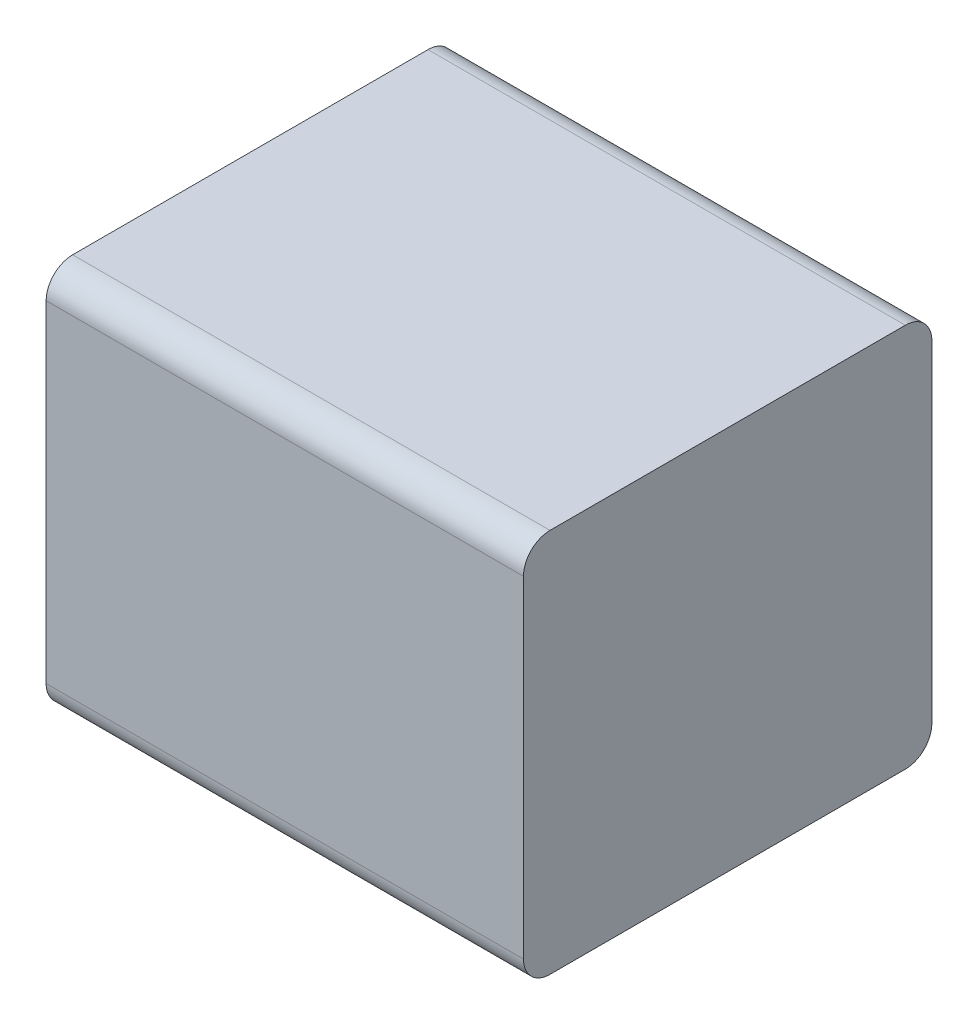
ISO-10303-21;
HEADER;
FILE_DESCRIPTION(('STEP AP214'),'2;1');
FILE_NAME('part.step','',(''),(''),'','','');
FILE_SCHEMA(('AUTOMOTIVE_DESIGN { 1 0 10303 214 1 1 1 1 }'));
ENDSEC;
DATA;
#1=APPLICATION_CONTEXT('core data for automotive mechanical design processes');
#2=APPLICATION_PROTOCOL_DEFINITION('international standard','automotive_design',2000,#1);
#3=PRODUCT_CONTEXT('',#1,'mechanical');
#4=PRODUCT('Part','Part','',(#3));
#5=PRODUCT_RELATED_PRODUCT_CATEGORY('part','',(#4));
#6=PRODUCT_DEFINITION_FORMATION('','',#4);
#7=PRODUCT_DEFINITION_CONTEXT('part definition',#1,'design');
#8=PRODUCT_DEFINITION('design','',#6,#7);
#9=PRODUCT_DEFINITION_SHAPE('','',#8);
#10=(LENGTH_UNIT() NAMED_UNIT(*) SI_UNIT(.MILLI.,.METRE.));
#11=(NAMED_UNIT(*) PLANE_ANGLE_UNIT() SI_UNIT($,.RADIAN.));
#12=(NAMED_UNIT(*) SI_UNIT($,.STERADIAN.) SOLID_ANGLE_UNIT());
#13=UNCERTAINTY_MEASURE_WITH_UNIT(LENGTH_MEASURE(1.E-05),#10,'distance_accuracy_value','');
#14=(GEOMETRIC_REPRESENTATION_CONTEXT(3) GLOBAL_UNCERTAINTY_ASSIGNED_CONTEXT((#13)) GLOBAL_UNIT_ASSIGNED_CONTEXT((#10,
#11,#12)) REPRESENTATION_CONTEXT('',''));
#15=CARTESIAN_POINT('',(0.,0.,0.));
#16=DIRECTION('',(0.,0.,1.));
#17=DIRECTION('',(1.,0.,0.));
#18=AXIS2_PLACEMENT_3D('',#15,#16,#17);
#19=CARTESIAN_POINT('',(-0.45,-0.35,0.05));
#20=DIRECTION('',(1.,0.,0.));
#21=DIRECTION('',(0.,1.,0.));
#22=AXIS2_PLACEMENT_3D('',#19,#20,#21);
#23=PLANE('',#22);
#24=CARTESIAN_POINT('',(-0.45,-0.3,0.77));
#25=DIRECTION('',(-1.,0.,0.));
#26=DIRECTION('',(0.,0.,1.));
#27=AXIS2_PLACEMENT_3D('',#24,#25,#26);
#28=CIRCLE('',#27,0.05);
#29=CARTESIAN_POINT('',(-0.45,-0.35,0.77));
#30=VERTEX_POINT('',#29);
#31=CARTESIAN_POINT('',(-0.45,-0.3,0.82));
#32=VERTEX_POINT('',#31);
#33=EDGE_CURVE('E11',#30,#32,#28,.T.);
#34=ORIENTED_EDGE('',*,*,#33,.T.);
#35=DIRECTION('',(0.,1.,0.));
#36=VECTOR('',#35,1.);
#37=CARTESIAN_POINT('',(-0.45,-0.35,0.82));
#38=LINE('',#37,#36);
#39=CARTESIAN_POINT('',(-0.45,0.325,0.82));
#40=VERTEX_POINT('',#39);
#41=EDGE_CURVE('E28',#32,#40,#38,.T.);
#42=ORIENTED_EDGE('',*,*,#41,.T.);
#43=CARTESIAN_POINT('',(-0.45,0.325,0.77));
#44=DIRECTION('',(1.,0.,0.));
#45=DIRECTION('',(0.,0.,1.));
#46=AXIS2_PLACEMENT_3D('',#43,#44,#45);
#47=CIRCLE('',#46,0.05);
#48=CARTESIAN_POINT('',(-0.45,0.375,0.77));
#49=VERTEX_POINT('',#48);
#50=EDGE_CURVE('E168',#49,#40,#47,.T.);
#51=ORIENTED_EDGE('',*,*,#50,.F.);
#52=DIRECTION('',(0.,0.,1.));
#53=VECTOR('',#52,1.);
#54=CARTESIAN_POINT('',(-0.45,0.375,0.05));
#55=LINE('',#54,#53);
#56=CARTESIAN_POINT('',(-0.45,0.375,0.1));
#57=VERTEX_POINT('',#56);
#58=EDGE_CURVE('E133',#57,#49,#55,.T.);
#59=ORIENTED_EDGE('',*,*,#58,.F.);
#60=CARTESIAN_POINT('',(-0.45,0.325,0.1));
#61=DIRECTION('',(-1.,0.,0.));
#62=DIRECTION('',(0.,0.,1.));
#63=AXIS2_PLACEMENT_3D('',#60,#61,#62);
#64=CIRCLE('',#63,0.05);
#65=CARTESIAN_POINT('',(-0.45,0.325,0.05));
#66=VERTEX_POINT('',#65);
#67=EDGE_CURVE('E131',#57,#66,#64,.T.);
#68=ORIENTED_EDGE('',*,*,#67,.T.);
#69=DIRECTION('',(0.,1.,0.));
#70=VECTOR('',#69,1.);
#71=CARTESIAN_POINT('',(-0.45,-0.35,0.05));
#72=LINE('',#71,#70);
#73=CARTESIAN_POINT('',(-0.45,-0.3,0.05));
#74=VERTEX_POINT('',#73);
#75=EDGE_CURVE('E120',#74,#66,#72,.T.);
#76=ORIENTED_EDGE('',*,*,#75,.F.);
#77=CARTESIAN_POINT('',(-0.45,-0.3,0.1));
#78=DIRECTION('',(1.,0.,0.));
#79=DIRECTION('',(0.,0.,1.));
#80=AXIS2_PLACEMENT_3D('',#77,#78,#79);
#81=CIRCLE('',#80,0.05);
#82=CARTESIAN_POINT('',(-0.45,-0.35,0.1));
#83=VERTEX_POINT('',#82);
#84=EDGE_CURVE('E165',#83,#74,#81,.T.);
#85=ORIENTED_EDGE('',*,*,#84,.F.);
#86=DIRECTION('',(0.,0.,1.));
#87=VECTOR('',#86,1.);
#88=CARTESIAN_POINT('',(-0.45,-0.35,0.05));
#89=LINE('',#88,#87);
#90=EDGE_CURVE('E138',#83,#30,#89,.T.);
#91=ORIENTED_EDGE('',*,*,#90,.T.);
#92=EDGE_LOOP('',(#34,#42,#51,#59,#68,#76,#85,#91));
#93=FACE_BOUND('',#92,.T.);
#94=ADVANCED_FACE('F17',(#93),#23,.F.);
#95=CARTESIAN_POINT('',(-0.45,-0.35,0.05));
#96=DIRECTION('',(0.,1.,0.));
#97=DIRECTION('',(1.,0.,0.));
#98=AXIS2_PLACEMENT_3D('',#95,#96,#97);
#99=PLANE('',#98);
#100=DIRECTION('',(1.,0.,0.));
#101=VECTOR('',#100,1.);
#102=CARTESIAN_POINT('',(-0.45,-0.35,0.77));
#103=LINE('',#102,#101);
#104=CARTESIAN_POINT('',(0.45,-0.35,0.77));
#105=VERTEX_POINT('',#104);
#106=EDGE_CURVE('E70',#30,#105,#103,.T.);
#107=ORIENTED_EDGE('',*,*,#106,.F.);
#108=ORIENTED_EDGE('',*,*,#90,.F.);
#109=DIRECTION('',(1.,0.,0.));
#110=VECTOR('',#109,1.);
#111=CARTESIAN_POINT('',(-0.45,-0.35,0.1));
#112=LINE('',#111,#110);
#113=CARTESIAN_POINT('',(0.45,-0.35,0.1));
#114=VERTEX_POINT('',#113);
#115=EDGE_CURVE('E158',#83,#114,#112,.T.);
#116=ORIENTED_EDGE('',*,*,#115,.T.);
#117=DIRECTION('',(0.,0.,1.));
#118=VECTOR('',#117,1.);
#119=CARTESIAN_POINT('',(0.45,-0.35,0.05));
#120=LINE('',#119,#118);
#121=EDGE_CURVE('E162',#114,#105,#120,.T.);
#122=ORIENTED_EDGE('',*,*,#121,.T.);
#123=EDGE_LOOP('',(#107,#108,#116,#122));
#124=FACE_BOUND('',#123,.T.);
#125=ADVANCED_FACE('F229',(#124),#99,.F.);
#126=CARTESIAN_POINT('',(-0.45,-0.3,0.1));
#127=DIRECTION('',(1.,0.,0.));
#128=DIRECTION('',(0.,-1.,0.));
#129=AXIS2_PLACEMENT_3D('',#126,#127,#128);
#130=CYLINDRICAL_SURFACE('',#129,0.05);
#131=ORIENTED_EDGE('',*,*,#84,.T.);
#132=DIRECTION('',(1.,0.,0.));
#133=VECTOR('',#132,1.);
#134=CARTESIAN_POINT('',(-0.45,-0.3,0.05));
#135=LINE('',#134,#133);
#136=CARTESIAN_POINT('',(0.45,-0.3,0.05));
#137=VERTEX_POINT('',#136);
#138=EDGE_CURVE('E125',#74,#137,#135,.T.);
#139=ORIENTED_EDGE('',*,*,#138,.T.);
#140=CARTESIAN_POINT('',(0.45,-0.3,0.1));
#141=DIRECTION('',(1.,0.,0.));
#142=DIRECTION('',(0.,0.,1.));
#143=AXIS2_PLACEMENT_3D('',#140,#141,#142);
#144=CIRCLE('',#143,0.05);
#145=EDGE_CURVE('E82',#114,#137,#144,.T.);
#146=ORIENTED_EDGE('',*,*,#145,.F.);
#147=ORIENTED_EDGE('',*,*,#115,.F.);
#148=EDGE_LOOP('',(#131,#139,#146,#147));
#149=FACE_BOUND('',#148,.T.);
#150=ADVANCED_FACE('F234',(#149),#130,.T.);
#151=CARTESIAN_POINT('',(-0.45,-0.3,0.77));
#152=DIRECTION('',(1.,0.,0.));
#153=DIRECTION('',(0.,-1.,0.));
#154=AXIS2_PLACEMENT_3D('',#151,#152,#153);
#155=CYLINDRICAL_SURFACE('',#154,0.05);
#156=ORIENTED_EDGE('',*,*,#106,.T.);
#157=CARTESIAN_POINT('',(0.45,-0.3,0.77));
#158=DIRECTION('',(-1.,0.,0.));
#159=DIRECTION('',(0.,0.,1.));
#160=AXIS2_PLACEMENT_3D('',#157,#158,#159);
#161=CIRCLE('',#160,0.05);
#162=CARTESIAN_POINT('',(0.45,-0.3,0.82));
#163=VERTEX_POINT('',#162);
#164=EDGE_CURVE('E143',#105,#163,#161,.T.);
#165=ORIENTED_EDGE('',*,*,#164,.T.);
#166=DIRECTION('',(1.,0.,0.));
#167=VECTOR('',#166,1.);
#168=CARTESIAN_POINT('',(-0.45,-0.3,0.82));
#169=LINE('',#168,#167);
#170=EDGE_CURVE('E89',#32,#163,#169,.T.);
#171=ORIENTED_EDGE('',*,*,#170,.F.);
#172=ORIENTED_EDGE('',*,*,#33,.F.);
#173=EDGE_LOOP('',(#156,#165,#171,#172));
#174=FACE_BOUND('',#173,.T.);
#175=ADVANCED_FACE('F19',(#174),#155,.T.);
#176=CARTESIAN_POINT('',(-0.45,-0.35,0.05));
#177=DIRECTION('',(0.,0.,1.));
#178=DIRECTION('',(1.,0.,0.));
#179=AXIS2_PLACEMENT_3D('',#176,#177,#178);
#180=PLANE('',#179);
#181=DIRECTION('',(1.,0.,0.));
#182=VECTOR('',#181,1.);
#183=CARTESIAN_POINT('',(-0.45,0.325,0.05));
#184=LINE('',#183,#182);
#185=CARTESIAN_POINT('',(0.45,0.325,0.05));
#186=VERTEX_POINT('',#185);
#187=EDGE_CURVE('E21',#66,#186,#184,.T.);
#188=ORIENTED_EDGE('',*,*,#187,.T.);
#189=DIRECTION('',(0.,1.,0.));
#190=VECTOR('',#189,1.);
#191=CARTESIAN_POINT('',(0.45,-0.35,0.05));
#192=LINE('',#191,#190);
#193=EDGE_CURVE('E96',#137,#186,#192,.T.);
#194=ORIENTED_EDGE('',*,*,#193,.F.);
#195=ORIENTED_EDGE('',*,*,#138,.F.);
#196=ORIENTED_EDGE('',*,*,#75,.T.);
#197=EDGE_LOOP('',(#188,#194,#195,#196));
#198=FACE_BOUND('',#197,.T.);
#199=ADVANCED_FACE('F122',(#198),#180,.F.);
#200=CARTESIAN_POINT('',(-0.45,-0.35,0.82));
#201=DIRECTION('',(0.,0.,1.));
#202=DIRECTION('',(1.,0.,0.));
#203=AXIS2_PLACEMENT_3D('',#200,#201,#202);
#204=PLANE('',#203);
#205=ORIENTED_EDGE('',*,*,#41,.F.);
#206=ORIENTED_EDGE('',*,*,#170,.T.);
#207=DIRECTION('',(0.,1.,0.));
#208=VECTOR('',#207,1.);
#209=CARTESIAN_POINT('',(0.45,-0.35,0.82));
#210=LINE('',#209,#208);
#211=CARTESIAN_POINT('',(0.45,0.325,0.82));
#212=VERTEX_POINT('',#211);
#213=EDGE_CURVE('E181',#163,#212,#210,.T.);
#214=ORIENTED_EDGE('',*,*,#213,.T.);
#215=DIRECTION('',(1.,0.,0.));
#216=VECTOR('',#215,1.);
#217=CARTESIAN_POINT('',(-0.45,0.325,0.82));
#218=LINE('',#217,#216);
#219=EDGE_CURVE('E166',#40,#212,#218,.T.);
#220=ORIENTED_EDGE('',*,*,#219,.F.);
#221=EDGE_LOOP('',(#205,#206,#214,#220));
#222=FACE_BOUND('',#221,.T.);
#223=ADVANCED_FACE('F217',(#222),#204,.T.);
#224=CARTESIAN_POINT('',(-0.45,0.325,0.1));
#225=DIRECTION('',(1.,0.,0.));
#226=DIRECTION('',(0.,1.,0.));
#227=AXIS2_PLACEMENT_3D('',#224,#225,#226);
#228=CYLINDRICAL_SURFACE('',#227,0.05);
#229=DIRECTION('',(1.,0.,0.));
#230=VECTOR('',#229,1.);
#231=CARTESIAN_POINT('',(-0.45,0.375,0.1));
#232=LINE('',#231,#230);
#233=CARTESIAN_POINT('',(0.45,0.375,0.1));
#234=VERTEX_POINT('',#233);
#235=EDGE_CURVE('E184',#57,#234,#232,.T.);
#236=ORIENTED_EDGE('',*,*,#235,.T.);
#237=CARTESIAN_POINT('',(0.45,0.325,0.1));
#238=DIRECTION('',(-1.,0.,0.));
#239=DIRECTION('',(0.,0.,1.));
#240=AXIS2_PLACEMENT_3D('',#237,#238,#239);
#241=CIRCLE('',#240,0.05);
#242=EDGE_CURVE('E141',#234,#186,#241,.T.);
#243=ORIENTED_EDGE('',*,*,#242,.T.);
#244=ORIENTED_EDGE('',*,*,#187,.F.);
#245=ORIENTED_EDGE('',*,*,#67,.F.);
#246=EDGE_LOOP('',(#236,#243,#244,#245));
#247=FACE_BOUND('',#246,.T.);
#248=ADVANCED_FACE('F140',(#247),#228,.T.);
#249=CARTESIAN_POINT('',(-0.45,0.325,0.77));
#250=DIRECTION('',(1.,0.,0.));
#251=DIRECTION('',(0.,1.,0.));
#252=AXIS2_PLACEMENT_3D('',#249,#250,#251);
#253=CYLINDRICAL_SURFACE('',#252,0.05);
#254=ORIENTED_EDGE('',*,*,#50,.T.);
#255=ORIENTED_EDGE('',*,*,#219,.T.);
#256=CARTESIAN_POINT('',(0.45,0.325,0.77));
#257=DIRECTION('',(1.,0.,0.));
#258=DIRECTION('',(0.,0.,1.));
#259=AXIS2_PLACEMENT_3D('',#256,#257,#258);
#260=CIRCLE('',#259,0.05);
#261=CARTESIAN_POINT('',(0.45,0.375,0.77));
#262=VERTEX_POINT('',#261);
#263=EDGE_CURVE('E194',#262,#212,#260,.T.);
#264=ORIENTED_EDGE('',*,*,#263,.F.);
#265=DIRECTION('',(1.,0.,0.));
#266=VECTOR('',#265,1.);
#267=CARTESIAN_POINT('',(-0.45,0.375,0.77));
#268=LINE('',#267,#266);
#269=EDGE_CURVE('E199',#49,#262,#268,.T.);
#270=ORIENTED_EDGE('',*,*,#269,.F.);
#271=EDGE_LOOP('',(#254,#255,#264,#270));
#272=FACE_BOUND('',#271,.T.);
#273=ADVANCED_FACE('F216',(#272),#253,.T.);
#274=CARTESIAN_POINT('',(-0.45,0.375,0.05));
#275=DIRECTION('',(0.,1.,0.));
#276=DIRECTION('',(1.,0.,0.));
#277=AXIS2_PLACEMENT_3D('',#274,#275,#276);
#278=PLANE('',#277);
#279=DIRECTION('',(0.,0.,1.));
#280=VECTOR('',#279,1.);
#281=CARTESIAN_POINT('',(0.45,0.375,0.05));
#282=LINE('',#281,#280);
#283=EDGE_CURVE('E161',#234,#262,#282,.T.);
#284=ORIENTED_EDGE('',*,*,#283,.F.);
#285=ORIENTED_EDGE('',*,*,#235,.F.);
#286=ORIENTED_EDGE('',*,*,#58,.T.);
#287=ORIENTED_EDGE('',*,*,#269,.T.);
#288=EDGE_LOOP('',(#284,#285,#286,#287));
#289=FACE_BOUND('',#288,.T.);
#290=ADVANCED_FACE('F207',(#289),#278,.T.);
#291=CARTESIAN_POINT('',(0.45,-0.35,0.05));
#292=DIRECTION('',(1.,0.,0.));
#293=DIRECTION('',(0.,1.,0.));
#294=AXIS2_PLACEMENT_3D('',#291,#292,#293);
#295=PLANE('',#294);
#296=ORIENTED_EDGE('',*,*,#121,.F.);
#297=ORIENTED_EDGE('',*,*,#145,.T.);
#298=ORIENTED_EDGE('',*,*,#193,.T.);
#299=ORIENTED_EDGE('',*,*,#242,.F.);
#300=ORIENTED_EDGE('',*,*,#283,.T.);
#301=ORIENTED_EDGE('',*,*,#263,.T.);
#302=ORIENTED_EDGE('',*,*,#213,.F.);
#303=ORIENTED_EDGE('',*,*,#164,.F.);
#304=EDGE_LOOP('',(#296,#297,#298,#299,#300,#301,#302,#303));
#305=FACE_BOUND('',#304,.T.);
#306=ADVANCED_FACE('F210',(#305),#295,.T.);
#307=CLOSED_SHELL('',(#94,#125,#150,#175,#199,#223,#248,#273,#290,#306));
#308=MANIFOLD_SOLID_BREP('B1',#307);
#309=ADVANCED_BREP_SHAPE_REPRESENTATION('',(#18,#308),#14);
#310=SHAPE_DEFINITION_REPRESENTATION(#9,#309);
ENDSEC;
END-ISO-10303-21;
